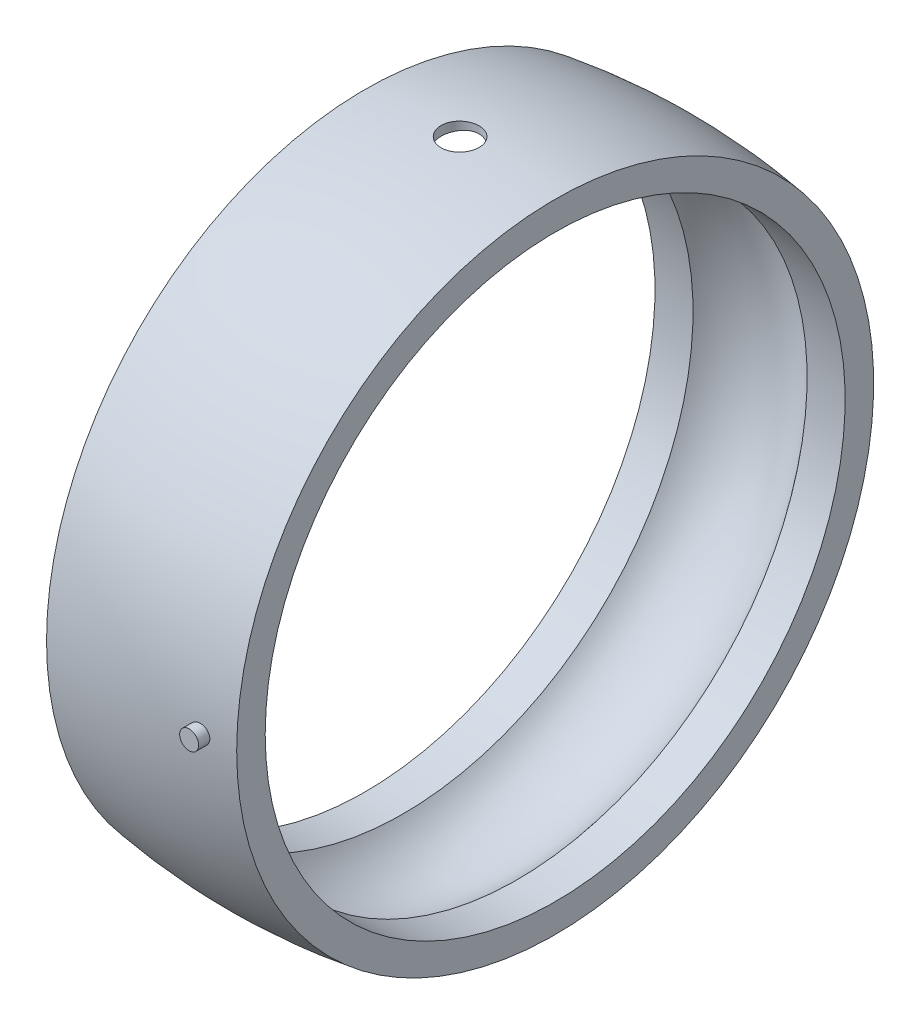
ISO-10303-21;
HEADER;
FILE_DESCRIPTION(('STEP AP214'),'2;1');
FILE_NAME('part.step','',(''),(''),'','','');
FILE_SCHEMA(('AUTOMOTIVE_DESIGN { 1 0 10303 214 1 1 1 1 }'));
ENDSEC;
DATA;
#1=APPLICATION_CONTEXT('core data for automotive mechanical design processes');
#2=APPLICATION_PROTOCOL_DEFINITION('international standard','automotive_design',2000,#1);
#3=PRODUCT_CONTEXT('',#1,'mechanical');
#4=PRODUCT('Part','Part','',(#3));
#5=PRODUCT_RELATED_PRODUCT_CATEGORY('part','',(#4));
#6=PRODUCT_DEFINITION_FORMATION('','',#4);
#7=PRODUCT_DEFINITION_CONTEXT('part definition',#1,'design');
#8=PRODUCT_DEFINITION('design','',#6,#7);
#9=PRODUCT_DEFINITION_SHAPE('','',#8);
#10=(LENGTH_UNIT() NAMED_UNIT(*) SI_UNIT(.MILLI.,.METRE.));
#11=(NAMED_UNIT(*) PLANE_ANGLE_UNIT() SI_UNIT($,.RADIAN.));
#12=(NAMED_UNIT(*) SI_UNIT($,.STERADIAN.) SOLID_ANGLE_UNIT());
#13=UNCERTAINTY_MEASURE_WITH_UNIT(LENGTH_MEASURE(1.E-05),#10,'distance_accuracy_value','');
#14=(GEOMETRIC_REPRESENTATION_CONTEXT(3) GLOBAL_UNCERTAINTY_ASSIGNED_CONTEXT((#13)) GLOBAL_UNIT_ASSIGNED_CONTEXT((#10,
#11,#12)) REPRESENTATION_CONTEXT('',''));
#15=CARTESIAN_POINT('',(0.,0.,0.));
#16=DIRECTION('',(0.,0.,1.));
#17=DIRECTION('',(1.,0.,0.));
#18=AXIS2_PLACEMENT_3D('',#15,#16,#17);
#19=CARTESIAN_POINT('',(0.,0.,0.));
#20=DIRECTION('',(-1.,0.,0.));
#21=DIRECTION('',(0.,0.,1.));
#22=AXIS2_PLACEMENT_3D('',#19,#20,#21);
#23=DEGENERATE_TOROIDAL_SURFACE('',#22,33.760686883201,68.,.F.);
#24=CARTESIAN_POINT('',(5.79424123280217,-0.708452902232974,33.9846174120727));
#25=CARTESIAN_POINT('',(5.83419576421789,-0.748252087251668,33.9803699096574));
#26=CARTESIAN_POINT('',(5.87753799310226,-0.784676030454851,33.9757975299329));
#27=CARTESIAN_POINT('',(5.96973986631645,-0.849714277944207,33.9661686307796));
#28=CARTESIAN_POINT('',(6.01860644182588,-0.878318614054711,33.9611115043953));
#29=CARTESIAN_POINT('',(6.12040383459657,-0.926867442550482,33.9506950907888));
#30=CARTESIAN_POINT('',(6.17333204294037,-0.946817439998281,33.9453359981077));
#31=CARTESIAN_POINT('',(6.2817625575121,-0.977520915245705,33.9344894799926));
#32=CARTESIAN_POINT('',(6.33726420075434,-0.988276747981935,33.9290020877907));
#33=CARTESIAN_POINT('',(6.44942256479376,-1.00031508556704,33.9180527913149));
#34=CARTESIAN_POINT('',(6.50608169948572,-1.00157520508231,33.9125909775844));
#35=CARTESIAN_POINT('',(6.61882235253579,-0.994520728934451,33.9018626423328));
#36=CARTESIAN_POINT('',(6.67490384488714,-0.986205704061285,33.8965961295771));
#37=CARTESIAN_POINT('',(6.78487730524379,-0.960227262720838,33.8863999128181));
#38=CARTESIAN_POINT('',(6.83876976629034,-0.942565964052356,33.8814701327992));
#39=CARTESIAN_POINT('',(6.94283464823823,-0.898383394076083,33.8720666601858));
#40=CARTESIAN_POINT('',(6.99300712527476,-0.871862256498065,33.8675929607086));
#41=CARTESIAN_POINT('',(7.08804883565756,-0.810789827388413,33.8592134845754));
#42=CARTESIAN_POINT('',(7.1329328495422,-0.776261757610155,33.8553061176959));
#43=CARTESIAN_POINT('',(7.21626692883179,-0.700105391185724,33.8481228160652));
#44=CARTESIAN_POINT('',(7.25471713447494,-0.658477249340296,33.8448468675506));
#45=CARTESIAN_POINT('',(7.3239333277851,-0.569473386464889,33.8389973443339));
#46=CARTESIAN_POINT('',(7.35472813192132,-0.522120248206806,33.836421132183));
#47=CARTESIAN_POINT('',(7.4079305290638,-0.422884749060281,33.8319969660148));
#48=CARTESIAN_POINT('',(7.43033826789998,-0.371002466941576,33.8301489993351));
#49=CARTESIAN_POINT('',(7.46605596288666,-0.264362746255524,33.8272140288279));
#50=CARTESIAN_POINT('',(7.47939516225759,-0.209615168419928,33.8261245787435));
#51=CARTESIAN_POINT('',(7.49670533848528,-0.0986490217908202,33.8247123437373));
#52=CARTESIAN_POINT('',(7.50067643229971,-0.0424304713707715,33.824389549244));
#53=CARTESIAN_POINT('',(7.49913662601305,0.0697753344369539,33.8245149046828));
#54=CARTESIAN_POINT('',(7.49364256734291,0.125762823327804,33.8249616853027));
#55=CARTESIAN_POINT('',(7.47336408144721,0.236017280624292,33.8266174461807));
#56=CARTESIAN_POINT('',(7.45857968508854,0.290284254745662,33.8278264239064));
#57=CARTESIAN_POINT('',(7.42014794469996,0.395560110303482,33.8309894334882));
#58=CARTESIAN_POINT('',(7.39650055414324,0.446568974634644,33.8329434692556));
#59=CARTESIAN_POINT('',(7.34102464484385,0.543888587750396,33.8375669625911));
#60=CARTESIAN_POINT('',(7.30919607758434,0.590199308671302,33.840236424402));
#61=CARTESIAN_POINT('',(7.23820791064509,0.676900098284006,33.8462520520276));
#62=CARTESIAN_POINT('',(7.1990353463656,0.717279467818314,33.8495994154157));
#63=CARTESIAN_POINT('',(7.11451840858074,0.790890460562093,33.8569068082775));
#64=CARTESIAN_POINT('',(7.06917394149094,0.824121975369088,33.8608668470414));
#65=CARTESIAN_POINT('',(6.97344833880013,0.882611399556227,33.8693335880858));
#66=CARTESIAN_POINT('',(6.92305139681809,0.907843188474173,33.8738420159847));
#67=CARTESIAN_POINT('',(6.81877635252658,0.949491350673391,33.883294838375));
#68=CARTESIAN_POINT('',(6.76489817686442,0.965907538134212,33.8882392420535));
#69=CARTESIAN_POINT('',(6.65497194199208,0.989523137849101,33.8984629753956));
#70=CARTESIAN_POINT('',(6.5989163871399,0.996687140196719,33.9037435111257));
#71=CARTESIAN_POINT('',(6.48641520328287,1.00149166053224,33.9144815074272));
#72=CARTESIAN_POINT('',(6.42996956643534,0.999131986485057,33.919938971564));
#73=CARTESIAN_POINT('',(6.31811773063093,0.984939588851092,33.9308895100681));
#74=CARTESIAN_POINT('',(6.26271500293298,0.973079536650568,33.9363826417553));
#75=CARTESIAN_POINT('',(6.1546875446639,0.940184744219662,33.9472184237649));
#76=CARTESIAN_POINT('',(6.10206283174678,0.919149945692509,33.9525610731308));
#77=CARTESIAN_POINT('',(6.00107499597472,0.868484872752339,33.9629208252582));
#78=CARTESIAN_POINT('',(5.95271296098082,0.838852412397666,33.9679378448313));
#79=CARTESIAN_POINT('',(5.86165203342818,0.771821245895768,33.9774695305594));
#80=CARTESIAN_POINT('',(5.81895307753752,0.734422626611854,33.9819842023321));
#81=CARTESIAN_POINT('',(5.74057915845812,0.653040040567088,33.9903322150018));
#82=CARTESIAN_POINT('',(5.70488239722449,0.609077285842166,33.9941676665872));
#83=CARTESIAN_POINT('',(5.6413855626475,0.515720624659675,34.0010286422259));
#84=CARTESIAN_POINT('',(5.61358526784524,0.466326870570102,34.0040541889931));
#85=CARTESIAN_POINT('',(5.56682791141432,0.363795947951438,34.0091623244851));
#86=CARTESIAN_POINT('',(5.54782386216161,0.310680456622866,34.0112499217343));
#87=CARTESIAN_POINT('',(5.5189995070393,0.2019871883322,34.0144224487614));
#88=CARTESIAN_POINT('',(5.50917855460267,0.146409585012069,34.0155074491307));
#89=CARTESIAN_POINT('',(5.49903487470736,0.0346603740916776,34.0166281849652));
#90=CARTESIAN_POINT('',(5.498665723786,-0.0215069741742343,34.0166690488087));
#91=CARTESIAN_POINT('',(5.50732054341644,-0.133119133957892,34.0157126747762));
#92=CARTESIAN_POINT('',(5.51634673743213,-0.188563771297021,34.0147151911691));
#93=CARTESIAN_POINT('',(5.54351323860095,-0.297087015926202,34.0117237803805));
#94=CARTESIAN_POINT('',(5.56164559597571,-0.350167643093911,34.0097307223542));
#95=CARTESIAN_POINT('',(5.60648096272704,-0.452477799966515,34.0048286196737));
#96=CARTESIAN_POINT('',(5.63317371597096,-0.501711850878179,34.0019206712201));
#97=CARTESIAN_POINT('',(5.68266412353198,-0.577197170255217,33.9965665206363));
#98=CARTESIAN_POINT('',(5.70307487212936,-0.605061379128535,33.9943661076422));
#99=CARTESIAN_POINT('',(5.74664866228779,-0.658521970025587,33.9896900854703));
#100=CARTESIAN_POINT('',(5.76981170100139,-0.684118354395515,33.987214476577));
#101=CARTESIAN_POINT('',(5.79424123280217,-0.708452902232974,33.9846174120727));
#102=B_SPLINE_CURVE_WITH_KNOTS('',3,(#24,#25,#26,#27,#28,#29,#30,#31,#32,#33,#34,#35,#36,#37,
#38,#39,#40,#41,#42,#43,#44,#45,#46,#47,#48,#49,#50,#51,#52,#53,#54,#55,#56,#57,#58,#59,#60,#61,
#62,#63,#64,#65,#66,#67,#68,#69,#70,#71,#72,#73,#74,#75,#76,#77,#78,#79,#80,#81,#82,#83,#84,#85,
#86,#87,#88,#89,#90,#91,#92,#93,#94,#95,#96,#97,#98,#99,#100,#101),.UNSPECIFIED.,.T.,.F.,(4,2,2,
2,2,2,2,2,2,2,2,2,2,2,2,2,2,2,2,2,2,2,2,2,2,2,2,2,2,2,2,2,2,2,2,2,2,2,4),(0.,0.169535853560678,
0.339286828556936,0.508929665315376,0.678529037773734,0.848528101573984,1.01853478595326,
1.18850296451798,1.3584685777111,1.52794728780575,1.69742230327905,1.86624937755632,
2.03507351622004,2.20335063389878,2.37162565068257,2.53960156336122,2.70757691794747,
2.87555315434271,3.04353038691088,3.21180699615611,3.38008615726001,3.54890925084431,
3.71773590284175,3.8872067908754,4.05668109613116,4.22664466630787,4.39660931645685,
4.56661721776803,4.73662321766901,4.9060912786436,5.07555458636347,5.24410190310335,
5.41263735180513,5.5803448622614,5.74809207071681,5.9156930879716,6.08309404946121,
6.18675402654112,6.29041389637762),.UNSPECIFIED.);
#103=CARTESIAN_POINT('',(5.79424123280217,-0.708452902232974,33.9846174120727));
#104=VERTEX_POINT('',#103);
#105=EDGE_CURVE('E10',#104,#104,#102,.T.);
#106=ORIENTED_EDGE('',*,*,#105,.F.);
#107=EDGE_LOOP('',(#106));
#108=FACE_BOUND('',#107,.T.);
#109=CARTESIAN_POINT('',(-10.,0.,0.));
#110=DIRECTION('',(-1.,0.,0.));
#111=DIRECTION('',(0.,0.,1.));
#112=AXIS2_PLACEMENT_3D('',#109,#110,#111);
#113=CIRCLE('',#112,33.5);
#114=CARTESIAN_POINT('',(-10.,0.,33.5));
#115=VERTEX_POINT('',#114);
#116=EDGE_CURVE('E72',#115,#115,#113,.T.);
#117=ORIENTED_EDGE('',*,*,#116,.F.);
#118=EDGE_LOOP('',(#117));
#119=FACE_BOUND('',#118,.T.);
#120=CARTESIAN_POINT('',(10.,0.,0.));
#121=DIRECTION('',(-1.,0.,0.));
#122=DIRECTION('',(0.,0.,1.));
#123=AXIS2_PLACEMENT_3D('',#120,#121,#122);
#124=CIRCLE('',#123,33.5);
#125=CARTESIAN_POINT('',(10.,0.,33.5));
#126=VERTEX_POINT('',#125);
#127=EDGE_CURVE('E75',#126,#126,#124,.T.);
#128=ORIENTED_EDGE('',*,*,#127,.T.);
#129=EDGE_LOOP('',(#128));
#130=FACE_BOUND('',#129,.T.);
#131=CARTESIAN_POINT('',(-1.41077487665913,34.1953038808793,-1.41764390711797));
#132=CARTESIAN_POINT('',(-1.4903964675902,34.1969351214215,-1.33840112425095));
#133=CARTESIAN_POINT('',(-1.56338403804714,34.1985687568063,-1.25237751175293));
#134=CARTESIAN_POINT('',(-1.69394143836922,34.2016560287472,-1.06922339946049));
#135=CARTESIAN_POINT('',(-1.75149274341492,34.2031094479143,-0.972079752302603));
#136=CARTESIAN_POINT('',(-1.84944618984625,34.2056701500967,-0.769539840739205));
#137=CARTESIAN_POINT('',(-1.88985619856797,34.2067775918436,-0.664147388652312));
#138=CARTESIAN_POINT('',(-1.95239680655631,34.2085219601566,-0.448098916981916));
#139=CARTESIAN_POINT('',(-1.97453194924122,34.209159003667,-0.337444212916447));
#140=CARTESIAN_POINT('',(-1.99991052860122,34.2098912001493,-0.114005663488773));
#141=CARTESIAN_POINT('',(-2.00315714349442,34.2099864442853,-0.00122217952316694));
#142=CARTESIAN_POINT('',(-1.99067367377047,34.2096245296926,0.223292895959499));
#143=CARTESIAN_POINT('',(-1.97494286883023,34.2091673499957,0.335024447386278));
#144=CARTESIAN_POINT('',(-1.92495635857726,34.2077522301173,0.554237053278912));
#145=CARTESIAN_POINT('',(-1.89070432000776,34.2067943890556,0.661718944553417));
#146=CARTESIAN_POINT('',(-1.80465136039041,34.2044859016261,0.869406914201825));
#147=CARTESIAN_POINT('',(-1.75285044069088,34.2031352552885,0.969612993134742));
#148=CARTESIAN_POINT('',(-1.63315298630873,34.200192835174,1.15993644122281));
#149=CARTESIAN_POINT('',(-1.56525186656051,34.1986009927553,1.25005092567898));
#150=CARTESIAN_POINT('',(-1.41528813770077,34.195355799664,1.41760371519908));
#151=CARTESIAN_POINT('',(-1.33322552462646,34.1937024489742,1.49504201671584));
#152=CARTESIAN_POINT('',(-1.15723816006236,34.1905200407487,1.63506830664123));
#153=CARTESIAN_POINT('',(-1.0633098042215,34.1889910212129,1.6976517660266));
#154=CARTESIAN_POINT('',(-0.866275029620566,34.1862302893714,1.80616078161443));
#155=CARTESIAN_POINT('',(-0.763168610937111,34.1849985770633,1.85208633795595));
#156=CARTESIAN_POINT('',(-0.550720239306992,34.1829716092354,1.92596819969914));
#157=CARTESIAN_POINT('',(-0.441379223610052,34.1821762883028,1.9539271983081));
#158=CARTESIAN_POINT('',(-0.219552803214996,34.1811115961197,1.99109103433891));
#159=CARTESIAN_POINT('',(-0.107067407731498,34.180842223328,2.00029592671393));
#160=CARTESIAN_POINT('',(0.11781029209421,34.180859833735,1.99968964727708));
#161=CARTESIAN_POINT('',(0.230202615480135,34.1811466111616,1.98988550868608));
#162=CARTESIAN_POINT('',(0.451745119587417,34.1822437524188,1.95155423925328));
#163=CARTESIAN_POINT('',(0.560895300052478,34.1830541162908,1.9230271069314));
#164=CARTESIAN_POINT('',(0.77285490255499,34.1851070145604,1.84806164793045));
#165=CARTESIAN_POINT('',(0.87566440558198,34.1863495434366,1.80162355008331));
#166=CARTESIAN_POINT('',(1.07202948663391,34.1891267082329,1.69215499215792));
#167=CARTESIAN_POINT('',(1.1655850419643,34.1906613448694,1.62912449138954));
#168=CARTESIAN_POINT('',(1.34082303391881,34.193850409172,1.48823313307551));
#169=CARTESIAN_POINT('',(1.42250113093233,34.1955048802924,1.41036687894597));
#170=CARTESIAN_POINT('',(1.57162744515297,34.1987466569096,1.24202714718768));
#171=CARTESIAN_POINT('',(1.63907564529689,34.2003339623258,1.15155365444167));
#172=CARTESIAN_POINT('',(1.75783850008757,34.2032627857621,0.960548210821167));
#173=CARTESIAN_POINT('',(1.80915036326174,34.2046042612386,0.86001452356486));
#174=CARTESIAN_POINT('',(1.89416616564292,34.2068898344453,0.651754865840094));
#175=CARTESIAN_POINT('',(1.92787014228889,34.2078339330204,0.544028910664823));
#176=CARTESIAN_POINT('',(1.97670406532978,34.2092180845198,0.324475699715762));
#177=CARTESIAN_POINT('',(1.99183936632787,34.20965828275,0.212649635864358));
#178=CARTESIAN_POINT('',(2.00312277318061,34.2099854966854,-0.0119570752300596));
#179=CARTESIAN_POINT('',(1.99927090988526,34.2098725132893,-0.124737720921789));
#180=CARTESIAN_POINT('',(1.97269377117421,34.209106221555,-0.348016521275595));
#181=CARTESIAN_POINT('',(1.94997413956084,34.2084530747928,-0.458515348355901));
#182=CARTESIAN_POINT('',(1.88631511618733,34.2066802543228,-0.674129673807328));
#183=CARTESIAN_POINT('',(1.845375723482,34.2055605805909,-0.779245171899179));
#184=CARTESIAN_POINT('',(1.74643254530968,34.2029806151499,-0.981127902354045));
#185=CARTESIAN_POINT('',(1.68842609500079,34.2015202702559,-1.07789382796525));
#186=CARTESIAN_POINT('',(1.55699726779275,34.1984235443729,-1.26031642695935));
#187=CARTESIAN_POINT('',(1.48357482457795,34.1967871626266,-1.34597305255032));
#188=CARTESIAN_POINT('',(1.32336621251255,34.1935220788719,-1.50377816746305));
#189=CARTESIAN_POINT('',(1.23657515658589,34.1918933798973,-1.57592169543139));
#190=CARTESIAN_POINT('',(1.05211019596582,34.188827886359,-1.70461474805086));
#191=CARTESIAN_POINT('',(0.954436269657208,34.1873910921764,-1.76116424172886));
#192=CARTESIAN_POINT('',(0.750974132817432,34.1848714437486,-1.85706396543821));
#193=CARTESIAN_POINT('',(0.645185728474921,34.1837885979606,-1.89641378451115));
#194=CARTESIAN_POINT('',(0.428504259294817,34.1820991515943,-1.95679135020549));
#195=CARTESIAN_POINT('',(0.317611406082212,34.181492531291,-1.97781985568991));
#196=CARTESIAN_POINT('',(0.0939209519981433,34.1808240945019,-2.00095396552443));
#197=CARTESIAN_POINT('',(-0.0188757292977505,34.1807620221336,-2.00306845756206));
#198=CARTESIAN_POINT('',(-0.243252975044092,34.1811891260495,-1.98833336912795));
#199=CARTESIAN_POINT('',(-0.354833234376658,34.1816784375664,-1.97147913638533));
#200=CARTESIAN_POINT('',(-0.573602938469068,34.1831533040749,-1.91927995120572));
#201=CARTESIAN_POINT('',(-0.680791023725413,34.1841390114793,-1.88392931953269));
#202=CARTESIAN_POINT('',(-0.887615102963033,34.1864949134733,-1.79575847588788));
#203=CARTESIAN_POINT('',(-0.987259937303159,34.1878646488539,-1.74295911518807));
#204=CARTESIAN_POINT('',(-1.14103276366516,34.1902799847253,-1.64408965172268));
#205=CARTESIAN_POINT('',(-1.19830654021064,34.1912566812058,-1.6028197004194));
#206=CARTESIAN_POINT('',(-1.30818346332806,34.19325656409,-1.51447205079039));
#207=CARTESIAN_POINT('',(-1.36078660855727,34.194279750507,-1.46739435079503));
#208=CARTESIAN_POINT('',(-1.41077487665913,34.1953038808793,-1.41764390711797));
#209=B_SPLINE_CURVE_WITH_KNOTS('',3,(#131,#132,#133,#134,#135,#136,#137,#138,#139,#140,#141,
#142,#143,#144,#145,#146,#147,#148,#149,#150,#151,#152,#153,#154,#155,#156,#157,#158,#159,#160,
#161,#162,#163,#164,#165,#166,#167,#168,#169,#170,#171,#172,#173,#174,#175,#176,#177,#178,#179,
#180,#181,#182,#183,#184,#185,#186,#187,#188,#189,#190,#191,#192,#193,#194,#195,#196,#197,#198,
#199,#200,#201,#202,#203,#204,#205,#206,#207,#208),.UNSPECIFIED.,.T.,.F.,(4,2,2,2,2,2,2,2,2,2,2,
2,2,2,2,2,2,2,2,2,2,2,2,2,2,2,2,2,2,2,2,2,2,2,2,2,2,2,4),(0.,0.336781423662345,
0.673965223181767,1.01099409765633,1.34793915621364,1.68482751814133,2.02172866769261,
2.3585631436091,2.69539759364594,3.03232808391168,3.3692586684603,3.70629184662606,
4.04332502197807,4.3803076638839,4.71728931836398,5.05414631556228,5.39100333938953,
5.727856059647,6.06470960598785,6.40168591933986,6.73866263676131,7.07569761675319,
7.41273188011784,7.74966893088213,8.08660543419747,8.42344118800492,8.76027695928635,
9.0971653518731,9.43405519369707,9.77106848370028,10.1080824430801,10.4451044544233,
10.7821125057573,11.1189621888157,11.4558945056599,11.7929303368178,12.1295648570354,
12.3410039285371,12.5524430608239),.UNSPECIFIED.);
#210=CARTESIAN_POINT('',(-1.41077487665913,34.1953038808793,-1.41764390711797));
#211=VERTEX_POINT('',#210);
#212=EDGE_CURVE('E78',#211,#211,#209,.T.);
#213=ORIENTED_EDGE('',*,*,#212,.F.);
#214=EDGE_LOOP('',(#213));
#215=FACE_BOUND('',#214,.T.);
#216=ADVANCED_FACE('F14',(#108,#119,#130,#215),#23,.F.);
#217=CARTESIAN_POINT('',(0.,0.,0.));
#218=DIRECTION('',(-1.,0.,0.));
#219=DIRECTION('',(0.,0.,1.));
#220=AXIS2_PLACEMENT_3D('',#217,#218,#219);
#221=TOROIDAL_SURFACE('',#220,26.,7.5);
#222=CARTESIAN_POINT('',(-6.,0.,0.));
#223=DIRECTION('',(-1.,0.,0.));
#224=DIRECTION('',(0.,0.,1.));
#225=AXIS2_PLACEMENT_3D('',#222,#223,#224);
#226=CIRCLE('',#225,30.5);
#227=CARTESIAN_POINT('',(-6.,0.,30.5));
#228=VERTEX_POINT('',#227);
#229=EDGE_CURVE('E30',#228,#228,#226,.T.);
#230=ORIENTED_EDGE('',*,*,#229,.T.);
#231=EDGE_LOOP('',(#230));
#232=FACE_BOUND('',#231,.T.);
#233=CARTESIAN_POINT('',(6.,0.,0.));
#234=DIRECTION('',(-1.,0.,0.));
#235=DIRECTION('',(0.,0.,1.));
#236=AXIS2_PLACEMENT_3D('',#233,#234,#235);
#237=CIRCLE('',#236,30.5);
#238=CARTESIAN_POINT('',(6.,0.,30.5));
#239=VERTEX_POINT('',#238);
#240=EDGE_CURVE('E26',#239,#239,#237,.T.);
#241=ORIENTED_EDGE('',*,*,#240,.F.);
#242=EDGE_LOOP('',(#241));
#243=FACE_BOUND('',#242,.T.);
#244=CARTESIAN_POINT('',(-1.50377622324577,33.3216185459098,-1.31858140839838));
#245=CARTESIAN_POINT('',(-1.42973746045624,33.3334409437826,-1.40301381309583));
#246=CARTESIAN_POINT('',(-1.34855656632389,33.3454861527996,-1.48121968270018));
#247=CARTESIAN_POINT('',(-1.17410305396861,33.368684367473,-1.62300138857166));
#248=CARTESIAN_POINT('',(-1.08082134108421,33.3798366917609,-1.68656612018623));
#249=CARTESIAN_POINT('',(-0.884682176411816,33.4000223521673,-1.79722433282212));
#250=CARTESIAN_POINT('',(-0.781821455187406,33.4090549610702,-1.84431216378839));
#251=CARTESIAN_POINT('',(-0.569455625050496,33.4239993317135,-1.92053182424339));
#252=CARTESIAN_POINT('',(-0.45995230972988,33.429911931754,-1.94966847730032));
#253=CARTESIAN_POINT('',(-0.238888079403805,33.4379132475285,-1.98881145830742));
#254=CARTESIAN_POINT('',(-0.127371413978923,33.4400499185605,-1.99905777203729));
#255=CARTESIAN_POINT('',(0.0958141251554883,33.4404147008735,-2.00081774323238));
#256=CARTESIAN_POINT('',(0.207482991719462,33.4386429897299,-1.99233225176745));
#257=CARTESIAN_POINT('',(0.426347087789947,33.4314301593722,-1.95713116684985));
#258=CARTESIAN_POINT('',(0.533580704350791,33.4260349972117,-1.93064384501398));
#259=CARTESIAN_POINT('',(0.742062352378528,33.4121919185545,-1.86049513846712));
#260=CARTESIAN_POINT('',(0.843310047882229,33.4037438308996,-1.81683279084872));
#261=CARTESIAN_POINT('',(1.03809404694311,33.3845819760289,-1.71308503796552));
#262=CARTESIAN_POINT('',(1.13154215444451,33.3738461909495,-1.65283824134065));
#263=CARTESIAN_POINT('',(1.30711842121411,33.3513023307182,-1.51779806664283));
#264=CARTESIAN_POINT('',(1.38924517011431,33.3394941222715,-1.44300287898472));
#265=CARTESIAN_POINT('',(1.54139015621341,33.3158614643095,-1.27938219933009));
#266=CARTESIAN_POINT('',(1.61116296647593,33.3040405718121,-1.19032774522061));
#267=CARTESIAN_POINT('',(1.73479470473271,33.2819488417827,-1.00160456726088));
#268=CARTESIAN_POINT('',(1.78865374808722,33.2716779930145,-0.901935920360938));
#269=CARTESIAN_POINT('',(1.8787979638016,33.2539122870485,-0.694872763565902));
#270=CARTESIAN_POINT('',(1.91510809261538,33.2464134912837,-0.587489476016285));
#271=CARTESIAN_POINT('',(1.96910649772232,33.2350916238842,-0.367956502350477));
#272=CARTESIAN_POINT('',(1.98679767185928,33.2312679802589,-0.255807560785658));
#273=CARTESIAN_POINT('',(2.00281024954803,33.2278109785589,-0.032348227979638));
#274=CARTESIAN_POINT('',(2.00151458084517,33.2280947798456,0.078933562555705));
#275=CARTESIAN_POINT('',(1.98052831652285,33.2326156590539,0.299661687768602));
#276=CARTESIAN_POINT('',(1.96083832624706,33.2368526068804,0.409108082727025));
#277=CARTESIAN_POINT('',(1.90389715098377,33.2487260680323,0.622308536934928));
#278=CARTESIAN_POINT('',(1.86676883417886,33.2563387755511,0.726096840226185));
#279=CARTESIAN_POINT('',(1.77610701108318,33.2740778251421,0.926009565754842));
#280=CARTESIAN_POINT('',(1.72257173282977,33.2842044386954,1.02213315878473));
#281=CARTESIAN_POINT('',(1.59951888305142,33.3060339764937,1.20580705106891));
#282=CARTESIAN_POINT('',(1.5297389901892,33.3177613005538,1.29317870296056));
#283=CARTESIAN_POINT('',(1.37662889915636,33.3413493862408,1.45509815575764));
#284=CARTESIAN_POINT('',(1.29329741624437,33.3532101604199,1.52964473941838));
#285=CARTESIAN_POINT('',(1.11401689903395,33.3759368090011,1.66485682191937));
#286=CARTESIAN_POINT('',(1.01790531949529,33.3867861409621,1.72530989840748));
#287=CARTESIAN_POINT('',(0.816655479688808,33.4060920707913,1.82917834527747));
#288=CARTESIAN_POINT('',(0.711517872448834,33.41454884157,1.8725949469744));
#289=CARTESIAN_POINT('',(0.496306073903485,33.4280608697696,1.94069269732854));
#290=CARTESIAN_POINT('',(0.386292829314465,33.4331497853552,1.96555956029054));
#291=CARTESIAN_POINT('',(0.163549215519308,33.439502198256,1.99646943083568));
#292=CARTESIAN_POINT('',(0.0508191748340803,33.4407661557771,2.00251470297134));
#293=CARTESIAN_POINT('',(-0.172024322495203,33.4393436269068,1.99564902707108));
#294=CARTESIAN_POINT('',(-0.282148709635931,33.4367268538198,1.98307260483883));
#295=CARTESIAN_POINT('',(-0.498677100351593,33.4279497544169,1.93997608903191));
#296=CARTESIAN_POINT('',(-0.605081081633642,33.4217894068715,1.90945588795661));
#297=CARTESIAN_POINT('',(-0.811359048425357,33.4065671752829,1.83135918137496));
#298=CARTESIAN_POINT('',(-0.911224426708871,33.3975015557674,1.78376070789502));
#299=CARTESIAN_POINT('',(-1.10162491853248,33.377424718111,1.67289049148052));
#300=CARTESIAN_POINT('',(-1.19215892592505,33.3664132697291,1.60961689342407));
#301=CARTESIAN_POINT('',(-1.36310772557632,33.3433922853339,1.46781976880457));
#302=CARTESIAN_POINT('',(-1.44330557971732,33.3313681084296,1.38903697578264));
#303=CARTESIAN_POINT('',(-1.58943452202873,33.3078291435743,1.21912089432767));
#304=CARTESIAN_POINT('',(-1.65536462429034,33.2963143908685,1.12798675311748));
#305=CARTESIAN_POINT('',(-1.77160315245111,33.2750119891649,0.934994754058282));
#306=CARTESIAN_POINT('',(-1.82177600302066,33.2652396260201,0.83305341163309));
#307=CARTESIAN_POINT('',(-1.90421181033676,33.2487145170766,0.621943088692651));
#308=CARTESIAN_POINT('',(-1.93647743053849,33.2419613222471,0.512775185734245));
#309=CARTESIAN_POINT('',(-1.98169806598783,33.2323886125655,0.292149658977284));
#310=CARTESIAN_POINT('',(-1.99495123431949,33.2295084076407,0.180755811136375));
#311=CARTESIAN_POINT('',(-2.00266641140963,33.2278394918332,-0.0427226327591736));
#312=CARTESIAN_POINT('',(-1.99712767167494,33.2290509439237,-0.154807256150332));
#313=CARTESIAN_POINT('',(-1.96767895779846,33.2353641028756,-0.374636965584155));
#314=CARTESIAN_POINT('',(-1.94405457678046,33.2404053238881,-0.482422363111563));
#315=CARTESIAN_POINT('',(-1.87952299546849,33.253707554469,-0.692419992842292));
#316=CARTESIAN_POINT('',(-1.83862651672634,33.261966566367,-0.79463563807134));
#317=CARTESIAN_POINT('',(-1.75140627925577,33.2787131679161,-0.969513377927602));
#318=CARTESIAN_POINT('',(-1.70817634638135,33.2867638379339,-1.04378152454292));
#319=CARTESIAN_POINT('',(-1.61260946188796,33.3037059190091,-1.18610224275271));
#320=CARTESIAN_POINT('',(-1.56027212467195,33.3125973656567,-1.25415455098962));
#321=CARTESIAN_POINT('',(-1.50377622324577,33.3216185459098,-1.31858140839838));
#322=B_SPLINE_CURVE_WITH_KNOTS('',3,(#244,#245,#246,#247,#248,#249,#250,#251,#252,#253,#254,
#255,#256,#257,#258,#259,#260,#261,#262,#263,#264,#265,#266,#267,#268,#269,#270,#271,#272,#273,
#274,#275,#276,#277,#278,#279,#280,#281,#282,#283,#284,#285,#286,#287,#288,#289,#290,#291,#292,
#293,#294,#295,#296,#297,#298,#299,#300,#301,#302,#303,#304,#305,#306,#307,#308,#309,#310,#311,
#312,#313,#314,#315,#316,#317,#318,#319,#320,#321),.UNSPECIFIED.,.T.,.F.,(4,2,2,2,2,2,2,2,2,2,2,
2,2,2,2,2,2,2,2,2,2,2,2,2,2,2,2,2,2,2,2,2,2,2,2,2,2,2,4),(0.,0.338445274060282,
0.677146404713306,1.01596356501557,1.3546896437586,1.6890820301863,2.02345922398217,
2.35367357448272,2.68390644088986,3.017474074348,3.35108322480145,3.69071648145439,
4.03034727601653,4.36949364720512,4.70858722603081,5.04085152465032,5.37310488908022,
5.70305157401853,6.03303390598123,6.36876816299748,6.70453426745088,7.04507411354848,
7.38558934251652,7.72264791577587,8.05966593367787,8.39070264539636,8.72174134036595,
9.05320738975597,9.38471268629305,9.72231998123643,10.0599505975686,10.4004112806813,
10.7408213113517,11.0758323836373,11.4108567997751,11.7406972211719,12.0703331963279,
12.3285757763879,12.5868292928037),.UNSPECIFIED.);
#323=CARTESIAN_POINT('',(-1.50377622324577,33.3216185459098,-1.31858140839838));
#324=VERTEX_POINT('',#323);
#325=EDGE_CURVE('E18',#324,#324,#322,.T.);
#326=ORIENTED_EDGE('',*,*,#325,.F.);
#327=EDGE_LOOP('',(#326));
#328=FACE_BOUND('',#327,.T.);
#329=ADVANCED_FACE('F61',(#232,#243,#328),#221,.F.);
#330=CARTESIAN_POINT('',(0.,0.,0.));
#331=DIRECTION('',(-1.,0.,0.));
#332=DIRECTION('',(0.,0.,1.));
#333=AXIS2_PLACEMENT_3D('',#330,#331,#332);
#334=CYLINDRICAL_SURFACE('',#333,30.5);
#335=CARTESIAN_POINT('',(10.,0.,0.));
#336=DIRECTION('',(-1.,0.,0.));
#337=DIRECTION('',(0.,0.,1.));
#338=AXIS2_PLACEMENT_3D('',#335,#336,#337);
#339=CIRCLE('',#338,30.5);
#340=CARTESIAN_POINT('',(10.,0.,30.5));
#341=VERTEX_POINT('',#340);
#342=EDGE_CURVE('E83',#341,#341,#339,.T.);
#343=ORIENTED_EDGE('',*,*,#342,.F.);
#344=EDGE_LOOP('',(#343));
#345=FACE_BOUND('',#344,.T.);
#346=ORIENTED_EDGE('',*,*,#240,.T.);
#347=EDGE_LOOP('',(#346));
#348=FACE_BOUND('',#347,.T.);
#349=ADVANCED_FACE('F16',(#345,#348),#334,.F.);
#350=CARTESIAN_POINT('',(0.,0.,0.));
#351=DIRECTION('',(-1.,0.,0.));
#352=DIRECTION('',(0.,0.,1.));
#353=AXIS2_PLACEMENT_3D('',#350,#351,#352);
#354=CYLINDRICAL_SURFACE('',#353,30.5);
#355=ORIENTED_EDGE('',*,*,#229,.F.);
#356=EDGE_LOOP('',(#355));
#357=FACE_BOUND('',#356,.T.);
#358=CARTESIAN_POINT('',(-10.,0.,0.));
#359=DIRECTION('',(-1.,0.,0.));
#360=DIRECTION('',(0.,0.,1.));
#361=AXIS2_PLACEMENT_3D('',#358,#359,#360);
#362=CIRCLE('',#361,30.5);
#363=CARTESIAN_POINT('',(-10.,0.,30.5));
#364=VERTEX_POINT('',#363);
#365=EDGE_CURVE('E168',#364,#364,#362,.T.);
#366=ORIENTED_EDGE('',*,*,#365,.T.);
#367=EDGE_LOOP('',(#366));
#368=FACE_BOUND('',#367,.T.);
#369=ADVANCED_FACE('F56',(#357,#368),#354,.F.);
#370=CARTESIAN_POINT('',(-10.,0.,-33.5));
#371=DIRECTION('',(1.,0.,0.));
#372=DIRECTION('',(0.,0.,-1.));
#373=AXIS2_PLACEMENT_3D('',#370,#371,#372);
#374=PLANE('',#373);
#375=ORIENTED_EDGE('',*,*,#365,.F.);
#376=EDGE_LOOP('',(#375));
#377=FACE_BOUND('',#376,.T.);
#378=ORIENTED_EDGE('',*,*,#116,.T.);
#379=EDGE_LOOP('',(#378));
#380=FACE_BOUND('',#379,.T.);
#381=ADVANCED_FACE('F49',(#377,#380),#374,.F.);
#382=CARTESIAN_POINT('',(10.,0.,-33.5));
#383=DIRECTION('',(-1.,0.,0.));
#384=DIRECTION('',(0.,0.,1.));
#385=AXIS2_PLACEMENT_3D('',#382,#383,#384);
#386=PLANE('',#385);
#387=ORIENTED_EDGE('',*,*,#127,.F.);
#388=EDGE_LOOP('',(#387));
#389=FACE_BOUND('',#388,.T.);
#390=ORIENTED_EDGE('',*,*,#342,.T.);
#391=EDGE_LOOP('',(#390));
#392=FACE_BOUND('',#391,.T.);
#393=ADVANCED_FACE('F46',(#389,#392),#386,.F.);
#394=CARTESIAN_POINT('',(6.5,0.,35.));
#395=DIRECTION('',(0.,0.,-1.));
#396=DIRECTION('',(-1.,0.,0.));
#397=AXIS2_PLACEMENT_3D('',#394,#395,#396);
#398=CYLINDRICAL_SURFACE('',#397,1.);
#399=CARTESIAN_POINT('',(6.5,0.,35.));
#400=DIRECTION('',(0.,0.,1.));
#401=DIRECTION('',(1.,0.,0.));
#402=AXIS2_PLACEMENT_3D('',#399,#400,#401);
#403=CIRCLE('',#402,1.);
#404=CARTESIAN_POINT('',(7.5,0.,35.));
#405=VERTEX_POINT('',#404);
#406=EDGE_CURVE('E80',#405,#405,#403,.T.);
#407=ORIENTED_EDGE('',*,*,#406,.F.);
#408=EDGE_LOOP('',(#407));
#409=FACE_BOUND('',#408,.T.);
#410=ORIENTED_EDGE('',*,*,#105,.T.);
#411=EDGE_LOOP('',(#410));
#412=FACE_BOUND('',#411,.T.);
#413=ADVANCED_FACE('F41',(#409,#412),#398,.T.);
#414=CARTESIAN_POINT('',(6.5,0.,35.));
#415=DIRECTION('',(0.,0.,1.));
#416=DIRECTION('',(1.,0.,0.));
#417=AXIS2_PLACEMENT_3D('',#414,#415,#416);
#418=PLANE('',#417);
#419=ORIENTED_EDGE('',*,*,#406,.T.);
#420=EDGE_LOOP('',(#419));
#421=FACE_BOUND('',#420,.T.);
#422=ADVANCED_FACE('F45',(#421),#418,.T.);
#423=CARTESIAN_POINT('',(0.,42.,0.));
#424=DIRECTION('',(0.,-1.,0.));
#425=DIRECTION('',(0.,0.,-1.));
#426=AXIS2_PLACEMENT_3D('',#423,#424,#425);
#427=CYLINDRICAL_SURFACE('',#426,2.);
#428=ORIENTED_EDGE('',*,*,#325,.T.);
#429=EDGE_LOOP('',(#428));
#430=FACE_BOUND('',#429,.T.);
#431=ORIENTED_EDGE('',*,*,#212,.T.);
#432=EDGE_LOOP('',(#431));
#433=FACE_BOUND('',#432,.T.);
#434=ADVANCED_FACE('F90',(#430,#433),#427,.F.);
#435=CLOSED_SHELL('',(#216,#329,#349,#369,#381,#393,#413,#422,#434));
#436=MANIFOLD_SOLID_BREP('B1',#435);
#437=ADVANCED_BREP_SHAPE_REPRESENTATION('',(#18,#436),#14);
#438=SHAPE_DEFINITION_REPRESENTATION(#9,#437);
ENDSEC;
END-ISO-10303-21;
